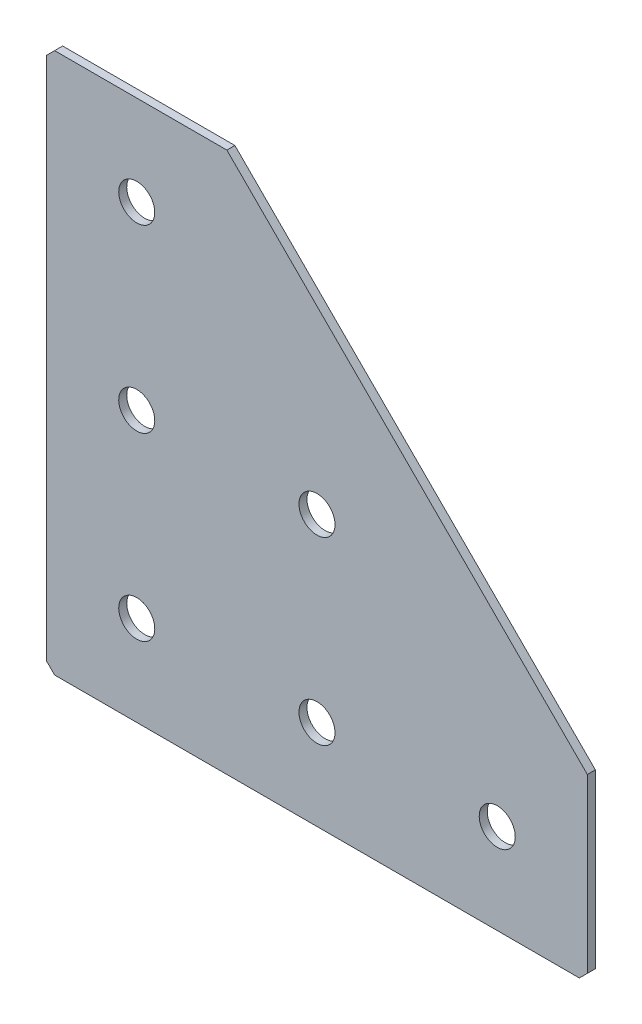
ISO-10303-21;
HEADER;
FILE_DESCRIPTION(('STEP AP214'),'2;1');
FILE_NAME('part.step','',(''),(''),'','','');
FILE_SCHEMA(('AUTOMOTIVE_DESIGN { 1 0 10303 214 1 1 1 1 }'));
ENDSEC;
DATA;
#1=APPLICATION_CONTEXT('core data for automotive mechanical design processes');
#2=APPLICATION_PROTOCOL_DEFINITION('international standard','automotive_design',2000,#1);
#3=PRODUCT_CONTEXT('',#1,'mechanical');
#4=PRODUCT('Part','Part','',(#3));
#5=PRODUCT_RELATED_PRODUCT_CATEGORY('part','',(#4));
#6=PRODUCT_DEFINITION_FORMATION('','',#4);
#7=PRODUCT_DEFINITION_CONTEXT('part definition',#1,'design');
#8=PRODUCT_DEFINITION('design','',#6,#7);
#9=PRODUCT_DEFINITION_SHAPE('','',#8);
#10=(LENGTH_UNIT() NAMED_UNIT(*) SI_UNIT(.MILLI.,.METRE.));
#11=(NAMED_UNIT(*) PLANE_ANGLE_UNIT() SI_UNIT($,.RADIAN.));
#12=(NAMED_UNIT(*) SI_UNIT($,.STERADIAN.) SOLID_ANGLE_UNIT());
#13=UNCERTAINTY_MEASURE_WITH_UNIT(LENGTH_MEASURE(1.E-05),#10,'distance_accuracy_value','');
#14=(GEOMETRIC_REPRESENTATION_CONTEXT(3) GLOBAL_UNCERTAINTY_ASSIGNED_CONTEXT((#13)) GLOBAL_UNIT_ASSIGNED_CONTEXT((#10,
#11,#12)) REPRESENTATION_CONTEXT('',''));
#15=CARTESIAN_POINT('',(0.,0.,0.));
#16=DIRECTION('',(0.,0.,1.));
#17=DIRECTION('',(1.,0.,0.));
#18=AXIS2_PLACEMENT_3D('',#15,#16,#17);
#19=CARTESIAN_POINT('',(45.,0.,-2.));
#20=DIRECTION('',(0.,-1.,0.));
#21=DIRECTION('',(1.,0.,0.));
#22=AXIS2_PLACEMENT_3D('',#19,#20,#21);
#23=PLANE('',#22);
#24=DIRECTION('',(1.,0.,0.));
#25=VECTOR('',#24,1.);
#26=CARTESIAN_POINT('',(45.,0.,-2.));
#27=LINE('',#26,#25);
#28=CARTESIAN_POINT('',(2.00000000000002,0.,-2.));
#29=VERTEX_POINT('',#28);
#30=CARTESIAN_POINT('',(45.,0.,-2.));
#31=VERTEX_POINT('',#30);
#32=EDGE_CURVE('E101',#29,#31,#27,.T.);
#33=ORIENTED_EDGE('',*,*,#32,.F.);
#34=DIRECTION('',(0.,0.,1.));
#35=VECTOR('',#34,1.);
#36=CARTESIAN_POINT('',(2.,0.,-2.));
#37=LINE('',#36,#35);
#38=CARTESIAN_POINT('',(2.00000000000002,0.,0.));
#39=VERTEX_POINT('',#38);
#40=EDGE_CURVE('E127',#29,#39,#37,.T.);
#41=ORIENTED_EDGE('',*,*,#40,.T.);
#42=DIRECTION('',(1.,0.,0.));
#43=VECTOR('',#42,1.);
#44=CARTESIAN_POINT('',(45.,0.,0.));
#45=LINE('',#44,#43);
#46=CARTESIAN_POINT('',(45.,0.,0.));
#47=VERTEX_POINT('',#46);
#48=EDGE_CURVE('E125',#39,#47,#45,.T.);
#49=ORIENTED_EDGE('',*,*,#48,.T.);
#50=DIRECTION('',(0.,0.,1.));
#51=VECTOR('',#50,1.);
#52=CARTESIAN_POINT('',(45.,0.,-2.));
#53=LINE('',#52,#51);
#54=EDGE_CURVE('E118',#31,#47,#53,.T.);
#55=ORIENTED_EDGE('',*,*,#54,.F.);
#56=EDGE_LOOP('',(#33,#41,#49,#55));
#57=FACE_BOUND('',#56,.T.);
#58=ADVANCED_FACE('F37',(#57),#23,.F.);
#59=CARTESIAN_POINT('',(135.,-90.,-2.));
#60=DIRECTION('',(-0.707106781186547,-0.707106781186547,0.));
#61=DIRECTION('',(0.707106781186548,-0.707106781186548,0.));
#62=AXIS2_PLACEMENT_3D('',#59,#60,#61);
#63=PLANE('',#62);
#64=DIRECTION('',(0.707106781186547,-0.707106781186547,0.));
#65=VECTOR('',#64,1.);
#66=CARTESIAN_POINT('',(135.,-90.,0.));
#67=LINE('',#66,#65);
#68=CARTESIAN_POINT('',(135.,-90.,0.));
#69=VERTEX_POINT('',#68);
#70=EDGE_CURVE('E164',#47,#69,#67,.T.);
#71=ORIENTED_EDGE('',*,*,#70,.T.);
#72=DIRECTION('',(0.,0.,1.));
#73=VECTOR('',#72,1.);
#74=CARTESIAN_POINT('',(135.,-90.,-2.));
#75=LINE('',#74,#73);
#76=CARTESIAN_POINT('',(135.,-90.,-2.));
#77=VERTEX_POINT('',#76);
#78=EDGE_CURVE('E120',#77,#69,#75,.T.);
#79=ORIENTED_EDGE('',*,*,#78,.F.);
#80=DIRECTION('',(0.707106781186547,-0.707106781186547,0.));
#81=VECTOR('',#80,1.);
#82=CARTESIAN_POINT('',(135.,-90.,-2.));
#83=LINE('',#82,#81);
#84=EDGE_CURVE('E105',#31,#77,#83,.T.);
#85=ORIENTED_EDGE('',*,*,#84,.F.);
#86=ORIENTED_EDGE('',*,*,#54,.T.);
#87=EDGE_LOOP('',(#71,#79,#85,#86));
#88=FACE_BOUND('',#87,.T.);
#89=ADVANCED_FACE('F117',(#88),#63,.F.);
#90=CARTESIAN_POINT('',(135.,-135.,-2.));
#91=DIRECTION('',(-1.,0.,0.));
#92=DIRECTION('',(0.,0.,1.));
#93=AXIS2_PLACEMENT_3D('',#90,#91,#92);
#94=PLANE('',#93);
#95=DIRECTION('',(0.,-1.,0.));
#96=VECTOR('',#95,1.);
#97=CARTESIAN_POINT('',(135.,-135.,0.));
#98=LINE('',#97,#96);
#99=CARTESIAN_POINT('',(135.,-133.,0.));
#100=VERTEX_POINT('',#99);
#101=EDGE_CURVE('E161',#69,#100,#98,.T.);
#102=ORIENTED_EDGE('',*,*,#101,.T.);
#103=DIRECTION('',(0.,0.,-1.));
#104=VECTOR('',#103,1.);
#105=CARTESIAN_POINT('',(135.,-133.,-2.));
#106=LINE('',#105,#104);
#107=CARTESIAN_POINT('',(135.,-133.,-2.));
#108=VERTEX_POINT('',#107);
#109=EDGE_CURVE('E11',#100,#108,#106,.T.);
#110=ORIENTED_EDGE('',*,*,#109,.T.);
#111=DIRECTION('',(0.,-1.,0.));
#112=VECTOR('',#111,1.);
#113=CARTESIAN_POINT('',(135.,-135.,-2.));
#114=LINE('',#113,#112);
#115=EDGE_CURVE('E122',#77,#108,#114,.T.);
#116=ORIENTED_EDGE('',*,*,#115,.F.);
#117=ORIENTED_EDGE('',*,*,#78,.T.);
#118=EDGE_LOOP('',(#102,#110,#116,#117));
#119=FACE_BOUND('',#118,.T.);
#120=ADVANCED_FACE('F245',(#119),#94,.F.);
#121=CARTESIAN_POINT('',(0.,-135.,-2.));
#122=DIRECTION('',(0.,1.,0.));
#123=DIRECTION('',(0.,0.,1.));
#124=AXIS2_PLACEMENT_3D('',#121,#122,#123);
#125=PLANE('',#124);
#126=DIRECTION('',(-1.,0.,0.));
#127=VECTOR('',#126,1.);
#128=CARTESIAN_POINT('',(0.,-135.,-2.));
#129=LINE('',#128,#127);
#130=CARTESIAN_POINT('',(133.,-135.,-2.));
#131=VERTEX_POINT('',#130);
#132=CARTESIAN_POINT('',(2.,-135.,-2.));
#133=VERTEX_POINT('',#132);
#134=EDGE_CURVE('E154',#131,#133,#129,.T.);
#135=ORIENTED_EDGE('',*,*,#134,.F.);
#136=DIRECTION('',(0.,0.,1.));
#137=VECTOR('',#136,1.);
#138=CARTESIAN_POINT('',(133.,-135.,-2.));
#139=LINE('',#138,#137);
#140=CARTESIAN_POINT('',(133.,-135.,0.));
#141=VERTEX_POINT('',#140);
#142=EDGE_CURVE('E45',#131,#141,#139,.T.);
#143=ORIENTED_EDGE('',*,*,#142,.T.);
#144=DIRECTION('',(-1.,0.,0.));
#145=VECTOR('',#144,1.);
#146=CARTESIAN_POINT('',(0.,-135.,0.));
#147=LINE('',#146,#145);
#148=CARTESIAN_POINT('',(2.,-135.,0.));
#149=VERTEX_POINT('',#148);
#150=EDGE_CURVE('E153',#141,#149,#147,.T.);
#151=ORIENTED_EDGE('',*,*,#150,.T.);
#152=DIRECTION('',(0.,0.,-1.));
#153=VECTOR('',#152,1.);
#154=CARTESIAN_POINT('',(2.,-135.,-2.));
#155=LINE('',#154,#153);
#156=EDGE_CURVE('E52',#149,#133,#155,.T.);
#157=ORIENTED_EDGE('',*,*,#156,.T.);
#158=EDGE_LOOP('',(#135,#143,#151,#157));
#159=FACE_BOUND('',#158,.T.);
#160=ADVANCED_FACE('F152',(#159),#125,.F.);
#161=CARTESIAN_POINT('',(0.,0.,-2.));
#162=DIRECTION('',(1.,0.,0.));
#163=DIRECTION('',(0.,0.,-1.));
#164=AXIS2_PLACEMENT_3D('',#161,#162,#163);
#165=PLANE('',#164);
#166=DIRECTION('',(0.,1.,0.));
#167=VECTOR('',#166,1.);
#168=CARTESIAN_POINT('',(0.,0.,0.));
#169=LINE('',#168,#167);
#170=CARTESIAN_POINT('',(0.,-133.,0.));
#171=VERTEX_POINT('',#170);
#172=CARTESIAN_POINT('',(0.,-2.00000000000003,0.));
#173=VERTEX_POINT('',#172);
#174=EDGE_CURVE('E113',#171,#173,#169,.T.);
#175=ORIENTED_EDGE('',*,*,#174,.T.);
#176=DIRECTION('',(0.,0.,-1.));
#177=VECTOR('',#176,1.);
#178=CARTESIAN_POINT('',(0.,-2.00000000000003,-2.));
#179=LINE('',#178,#177);
#180=CARTESIAN_POINT('',(0.,-2.00000000000003,-2.));
#181=VERTEX_POINT('',#180);
#182=EDGE_CURVE('E143',#173,#181,#179,.T.);
#183=ORIENTED_EDGE('',*,*,#182,.T.);
#184=DIRECTION('',(0.,1.,0.));
#185=VECTOR('',#184,1.);
#186=CARTESIAN_POINT('',(0.,0.,-2.));
#187=LINE('',#186,#185);
#188=CARTESIAN_POINT('',(0.,-133.,-2.));
#189=VERTEX_POINT('',#188);
#190=EDGE_CURVE('E131',#189,#181,#187,.T.);
#191=ORIENTED_EDGE('',*,*,#190,.F.);
#192=DIRECTION('',(0.,0.,1.));
#193=VECTOR('',#192,1.);
#194=CARTESIAN_POINT('',(0.,-133.,-2.));
#195=LINE('',#194,#193);
#196=EDGE_CURVE('E140',#189,#171,#195,.T.);
#197=ORIENTED_EDGE('',*,*,#196,.T.);
#198=EDGE_LOOP('',(#175,#183,#191,#197));
#199=FACE_BOUND('',#198,.T.);
#200=ADVANCED_FACE('F213',(#199),#165,.F.);
#201=CARTESIAN_POINT('',(0.,0.,-2.));
#202=DIRECTION('',(0.,0.,1.));
#203=DIRECTION('',(1.,0.,0.));
#204=AXIS2_PLACEMENT_3D('',#201,#202,#203);
#205=PLANE('',#204);
#206=CARTESIAN_POINT('',(67.5,-112.5,-2.00000000000001));
#207=DIRECTION('',(0.,0.,-1.));
#208=DIRECTION('',(0.,1.,0.));
#209=AXIS2_PLACEMENT_3D('',#206,#207,#208);
#210=CIRCLE('',#209,4.5);
#211=CARTESIAN_POINT('',(67.5,-108.,-2.00000000000001));
#212=VERTEX_POINT('',#211);
#213=EDGE_CURVE('E205',#212,#212,#210,.T.);
#214=ORIENTED_EDGE('',*,*,#213,.F.);
#215=EDGE_LOOP('',(#214));
#216=FACE_BOUND('',#215,.T.);
#217=CARTESIAN_POINT('',(22.5,-112.5,-2.00000000000001));
#218=DIRECTION('',(0.,0.,-1.));
#219=DIRECTION('',(0.,1.,0.));
#220=AXIS2_PLACEMENT_3D('',#217,#218,#219);
#221=CIRCLE('',#220,4.5);
#222=CARTESIAN_POINT('',(22.5,-108.,-2.00000000000001));
#223=VERTEX_POINT('',#222);
#224=EDGE_CURVE('E199',#223,#223,#221,.T.);
#225=ORIENTED_EDGE('',*,*,#224,.F.);
#226=EDGE_LOOP('',(#225));
#227=FACE_BOUND('',#226,.T.);
#228=CARTESIAN_POINT('',(22.5,-67.5,-2.));
#229=DIRECTION('',(0.,0.,-1.));
#230=DIRECTION('',(0.,1.,0.));
#231=AXIS2_PLACEMENT_3D('',#228,#229,#230);
#232=CIRCLE('',#231,4.5);
#233=CARTESIAN_POINT('',(22.5,-63.,-2.));
#234=VERTEX_POINT('',#233);
#235=EDGE_CURVE('E193',#234,#234,#232,.T.);
#236=ORIENTED_EDGE('',*,*,#235,.F.);
#237=EDGE_LOOP('',(#236));
#238=FACE_BOUND('',#237,.T.);
#239=CARTESIAN_POINT('',(22.5,-22.5,-2.));
#240=DIRECTION('',(0.,0.,-1.));
#241=DIRECTION('',(0.,1.,0.));
#242=AXIS2_PLACEMENT_3D('',#239,#240,#241);
#243=CIRCLE('',#242,4.5);
#244=CARTESIAN_POINT('',(22.5,-18.,-2.));
#245=VERTEX_POINT('',#244);
#246=EDGE_CURVE('E187',#245,#245,#243,.T.);
#247=ORIENTED_EDGE('',*,*,#246,.F.);
#248=EDGE_LOOP('',(#247));
#249=FACE_BOUND('',#248,.T.);
#250=CARTESIAN_POINT('',(112.5,-112.5,-2.00000000000001));
#251=DIRECTION('',(0.,0.,-1.));
#252=DIRECTION('',(0.,1.,0.));
#253=AXIS2_PLACEMENT_3D('',#250,#251,#252);
#254=CIRCLE('',#253,4.5);
#255=CARTESIAN_POINT('',(112.5,-108.,-2.00000000000001));
#256=VERTEX_POINT('',#255);
#257=EDGE_CURVE('E181',#256,#256,#254,.T.);
#258=ORIENTED_EDGE('',*,*,#257,.F.);
#259=EDGE_LOOP('',(#258));
#260=FACE_BOUND('',#259,.T.);
#261=CARTESIAN_POINT('',(67.5,-67.5,-2.));
#262=DIRECTION('',(0.,0.,-1.));
#263=DIRECTION('',(0.,1.,0.));
#264=AXIS2_PLACEMENT_3D('',#261,#262,#263);
#265=CIRCLE('',#264,4.5);
#266=CARTESIAN_POINT('',(67.5,-63.,-2.));
#267=VERTEX_POINT('',#266);
#268=EDGE_CURVE('E175',#267,#267,#265,.T.);
#269=ORIENTED_EDGE('',*,*,#268,.F.);
#270=EDGE_LOOP('',(#269));
#271=FACE_BOUND('',#270,.T.);
#272=ORIENTED_EDGE('',*,*,#190,.T.);
#273=DIRECTION('',(-0.707106781186543,-0.707106781186552,0.));
#274=VECTOR('',#273,1.);
#275=CARTESIAN_POINT('',(2.,0.,-2.));
#276=LINE('',#275,#274);
#277=EDGE_CURVE('E108',#181,#29,#276,.F.);
#278=ORIENTED_EDGE('',*,*,#277,.T.);
#279=ORIENTED_EDGE('',*,*,#32,.T.);
#280=ORIENTED_EDGE('',*,*,#84,.T.);
#281=ORIENTED_EDGE('',*,*,#115,.T.);
#282=DIRECTION('',(0.707106781186548,0.707106781186548,0.));
#283=VECTOR('',#282,1.);
#284=CARTESIAN_POINT('',(133.,-135.,-2.));
#285=LINE('',#284,#283);
#286=EDGE_CURVE('E59',#108,#131,#285,.F.);
#287=ORIENTED_EDGE('',*,*,#286,.T.);
#288=ORIENTED_EDGE('',*,*,#134,.T.);
#289=DIRECTION('',(0.707106781186548,-0.707106781186548,0.));
#290=VECTOR('',#289,1.);
#291=CARTESIAN_POINT('',(0.,-133.,-2.));
#292=LINE('',#291,#290);
#293=EDGE_CURVE('E145',#133,#189,#292,.F.);
#294=ORIENTED_EDGE('',*,*,#293,.T.);
#295=EDGE_LOOP('',(#272,#278,#279,#280,#281,#287,#288,#294));
#296=FACE_BOUND('',#295,.T.);
#297=ADVANCED_FACE('F104',(#216,#227,#238,#249,#260,#271,#296),#205,.F.);
#298=CARTESIAN_POINT('',(0.,0.,0.));
#299=DIRECTION('',(0.,0.,1.));
#300=DIRECTION('',(1.,0.,0.));
#301=AXIS2_PLACEMENT_3D('',#298,#299,#300);
#302=PLANE('',#301);
#303=CARTESIAN_POINT('',(67.5,-112.5,0.));
#304=DIRECTION('',(0.,0.,-1.));
#305=DIRECTION('',(0.,1.,0.));
#306=AXIS2_PLACEMENT_3D('',#303,#304,#305);
#307=CIRCLE('',#306,4.5);
#308=CARTESIAN_POINT('',(67.5,-108.,0.));
#309=VERTEX_POINT('',#308);
#310=EDGE_CURVE('E202',#309,#309,#307,.T.);
#311=ORIENTED_EDGE('',*,*,#310,.T.);
#312=EDGE_LOOP('',(#311));
#313=FACE_BOUND('',#312,.T.);
#314=CARTESIAN_POINT('',(22.5,-112.5,0.));
#315=DIRECTION('',(0.,0.,-1.));
#316=DIRECTION('',(0.,1.,0.));
#317=AXIS2_PLACEMENT_3D('',#314,#315,#316);
#318=CIRCLE('',#317,4.5);
#319=CARTESIAN_POINT('',(22.5,-108.,0.));
#320=VERTEX_POINT('',#319);
#321=EDGE_CURVE('E196',#320,#320,#318,.T.);
#322=ORIENTED_EDGE('',*,*,#321,.T.);
#323=EDGE_LOOP('',(#322));
#324=FACE_BOUND('',#323,.T.);
#325=CARTESIAN_POINT('',(22.5,-67.5,0.));
#326=DIRECTION('',(0.,0.,-1.));
#327=DIRECTION('',(0.,1.,0.));
#328=AXIS2_PLACEMENT_3D('',#325,#326,#327);
#329=CIRCLE('',#328,4.5);
#330=CARTESIAN_POINT('',(22.5,-63.,0.));
#331=VERTEX_POINT('',#330);
#332=EDGE_CURVE('E190',#331,#331,#329,.T.);
#333=ORIENTED_EDGE('',*,*,#332,.T.);
#334=EDGE_LOOP('',(#333));
#335=FACE_BOUND('',#334,.T.);
#336=CARTESIAN_POINT('',(22.5,-22.5,0.));
#337=DIRECTION('',(0.,0.,-1.));
#338=DIRECTION('',(0.,1.,0.));
#339=AXIS2_PLACEMENT_3D('',#336,#337,#338);
#340=CIRCLE('',#339,4.5);
#341=CARTESIAN_POINT('',(22.5,-18.,0.));
#342=VERTEX_POINT('',#341);
#343=EDGE_CURVE('E184',#342,#342,#340,.T.);
#344=ORIENTED_EDGE('',*,*,#343,.T.);
#345=EDGE_LOOP('',(#344));
#346=FACE_BOUND('',#345,.T.);
#347=CARTESIAN_POINT('',(112.5,-112.5,0.));
#348=DIRECTION('',(0.,0.,-1.));
#349=DIRECTION('',(0.,1.,0.));
#350=AXIS2_PLACEMENT_3D('',#347,#348,#349);
#351=CIRCLE('',#350,4.5);
#352=CARTESIAN_POINT('',(112.5,-108.,0.));
#353=VERTEX_POINT('',#352);
#354=EDGE_CURVE('E178',#353,#353,#351,.T.);
#355=ORIENTED_EDGE('',*,*,#354,.T.);
#356=EDGE_LOOP('',(#355));
#357=FACE_BOUND('',#356,.T.);
#358=CARTESIAN_POINT('',(67.5,-67.5,0.));
#359=DIRECTION('',(0.,0.,-1.));
#360=DIRECTION('',(0.,1.,0.));
#361=AXIS2_PLACEMENT_3D('',#358,#359,#360);
#362=CIRCLE('',#361,4.5);
#363=CARTESIAN_POINT('',(67.5,-63.,0.));
#364=VERTEX_POINT('',#363);
#365=EDGE_CURVE('E169',#364,#364,#362,.T.);
#366=ORIENTED_EDGE('',*,*,#365,.T.);
#367=EDGE_LOOP('',(#366));
#368=FACE_BOUND('',#367,.T.);
#369=ORIENTED_EDGE('',*,*,#48,.F.);
#370=DIRECTION('',(0.707106781186543,0.707106781186552,0.));
#371=VECTOR('',#370,1.);
#372=CARTESIAN_POINT('',(1.00000000000001,-1.,0.));
#373=LINE('',#372,#371);
#374=EDGE_CURVE('E138',#39,#173,#373,.F.);
#375=ORIENTED_EDGE('',*,*,#374,.T.);
#376=ORIENTED_EDGE('',*,*,#174,.F.);
#377=DIRECTION('',(-0.707106781186548,0.707106781186548,0.));
#378=VECTOR('',#377,1.);
#379=CARTESIAN_POINT('',(-66.5,-66.5,0.));
#380=LINE('',#379,#378);
#381=EDGE_CURVE('E129',#171,#149,#380,.F.);
#382=ORIENTED_EDGE('',*,*,#381,.T.);
#383=ORIENTED_EDGE('',*,*,#150,.F.);
#384=DIRECTION('',(-0.707106781186548,-0.707106781186548,0.));
#385=VECTOR('',#384,1.);
#386=CARTESIAN_POINT('',(134.,-134.,0.));
#387=LINE('',#386,#385);
#388=EDGE_CURVE('E136',#141,#100,#387,.F.);
#389=ORIENTED_EDGE('',*,*,#388,.T.);
#390=ORIENTED_EDGE('',*,*,#101,.F.);
#391=ORIENTED_EDGE('',*,*,#70,.F.);
#392=EDGE_LOOP('',(#369,#375,#376,#382,#383,#389,#390,#391));
#393=FACE_BOUND('',#392,.T.);
#394=ADVANCED_FACE('F157',(#313,#324,#335,#346,#357,#368,#393),#302,.T.);
#395=CARTESIAN_POINT('',(67.5,-67.5,-2.));
#396=DIRECTION('',(0.,0.,-1.));
#397=DIRECTION('',(0.,1.,0.));
#398=AXIS2_PLACEMENT_3D('',#395,#396,#397);
#399=CYLINDRICAL_SURFACE('',#398,4.5);
#400=ORIENTED_EDGE('',*,*,#365,.F.);
#401=EDGE_LOOP('',(#400));
#402=FACE_BOUND('',#401,.T.);
#403=ORIENTED_EDGE('',*,*,#268,.T.);
#404=EDGE_LOOP('',(#403));
#405=FACE_BOUND('',#404,.T.);
#406=ADVANCED_FACE('F225',(#402,#405),#399,.F.);
#407=CARTESIAN_POINT('',(112.5,-112.5,-2.00000000000001));
#408=DIRECTION('',(0.,0.,-1.));
#409=DIRECTION('',(0.,1.,0.));
#410=AXIS2_PLACEMENT_3D('',#407,#408,#409);
#411=CYLINDRICAL_SURFACE('',#410,4.5);
#412=ORIENTED_EDGE('',*,*,#354,.F.);
#413=EDGE_LOOP('',(#412));
#414=FACE_BOUND('',#413,.T.);
#415=ORIENTED_EDGE('',*,*,#257,.T.);
#416=EDGE_LOOP('',(#415));
#417=FACE_BOUND('',#416,.T.);
#418=ADVANCED_FACE('F227',(#414,#417),#411,.F.);
#419=CARTESIAN_POINT('',(22.5,-22.5,-2.));
#420=DIRECTION('',(0.,0.,-1.));
#421=DIRECTION('',(0.,1.,0.));
#422=AXIS2_PLACEMENT_3D('',#419,#420,#421);
#423=CYLINDRICAL_SURFACE('',#422,4.5);
#424=ORIENTED_EDGE('',*,*,#343,.F.);
#425=EDGE_LOOP('',(#424));
#426=FACE_BOUND('',#425,.T.);
#427=ORIENTED_EDGE('',*,*,#246,.T.);
#428=EDGE_LOOP('',(#427));
#429=FACE_BOUND('',#428,.T.);
#430=ADVANCED_FACE('F234',(#426,#429),#423,.F.);
#431=CARTESIAN_POINT('',(22.5,-67.5,-2.));
#432=DIRECTION('',(0.,0.,-1.));
#433=DIRECTION('',(0.,1.,0.));
#434=AXIS2_PLACEMENT_3D('',#431,#432,#433);
#435=CYLINDRICAL_SURFACE('',#434,4.5);
#436=ORIENTED_EDGE('',*,*,#332,.F.);
#437=EDGE_LOOP('',(#436));
#438=FACE_BOUND('',#437,.T.);
#439=ORIENTED_EDGE('',*,*,#235,.T.);
#440=EDGE_LOOP('',(#439));
#441=FACE_BOUND('',#440,.T.);
#442=ADVANCED_FACE('F329',(#438,#441),#435,.F.);
#443=CARTESIAN_POINT('',(22.5,-112.5,-2.00000000000001));
#444=DIRECTION('',(0.,0.,-1.));
#445=DIRECTION('',(0.,1.,0.));
#446=AXIS2_PLACEMENT_3D('',#443,#444,#445);
#447=CYLINDRICAL_SURFACE('',#446,4.5);
#448=ORIENTED_EDGE('',*,*,#321,.F.);
#449=EDGE_LOOP('',(#448));
#450=FACE_BOUND('',#449,.T.);
#451=ORIENTED_EDGE('',*,*,#224,.T.);
#452=EDGE_LOOP('',(#451));
#453=FACE_BOUND('',#452,.T.);
#454=ADVANCED_FACE('F322',(#450,#453),#447,.F.);
#455=CARTESIAN_POINT('',(67.5,-112.5,-2.00000000000001));
#456=DIRECTION('',(0.,0.,-1.));
#457=DIRECTION('',(0.,1.,0.));
#458=AXIS2_PLACEMENT_3D('',#455,#456,#457);
#459=CYLINDRICAL_SURFACE('',#458,4.5);
#460=ORIENTED_EDGE('',*,*,#310,.F.);
#461=EDGE_LOOP('',(#460));
#462=FACE_BOUND('',#461,.T.);
#463=ORIENTED_EDGE('',*,*,#213,.T.);
#464=EDGE_LOOP('',(#463));
#465=FACE_BOUND('',#464,.T.);
#466=ADVANCED_FACE('F209',(#462,#465),#459,.F.);
#467=CARTESIAN_POINT('',(2.,0.,-2.));
#468=DIRECTION('',(0.707106781186552,-0.707106781186542,0.));
#469=DIRECTION('',(0.,0.,1.));
#470=AXIS2_PLACEMENT_3D('',#467,#468,#469);
#471=PLANE('',#470);
#472=ORIENTED_EDGE('',*,*,#277,.F.);
#473=ORIENTED_EDGE('',*,*,#182,.F.);
#474=ORIENTED_EDGE('',*,*,#374,.F.);
#475=ORIENTED_EDGE('',*,*,#40,.F.);
#476=EDGE_LOOP('',(#472,#473,#474,#475));
#477=FACE_BOUND('',#476,.T.);
#478=ADVANCED_FACE('F249',(#477),#471,.F.);
#479=CARTESIAN_POINT('',(133.,-135.,-2.));
#480=DIRECTION('',(-0.707106781186547,0.707106781186547,0.));
#481=DIRECTION('',(0.,0.,1.));
#482=AXIS2_PLACEMENT_3D('',#479,#480,#481);
#483=PLANE('',#482);
#484=ORIENTED_EDGE('',*,*,#286,.F.);
#485=ORIENTED_EDGE('',*,*,#109,.F.);
#486=ORIENTED_EDGE('',*,*,#388,.F.);
#487=ORIENTED_EDGE('',*,*,#142,.F.);
#488=EDGE_LOOP('',(#484,#485,#486,#487));
#489=FACE_BOUND('',#488,.T.);
#490=ADVANCED_FACE('F251',(#489),#483,.F.);
#491=CARTESIAN_POINT('',(0.,-133.,-2.));
#492=DIRECTION('',(0.707106781186547,0.707106781186547,0.));
#493=DIRECTION('',(0.,0.,1.));
#494=AXIS2_PLACEMENT_3D('',#491,#492,#493);
#495=PLANE('',#494);
#496=ORIENTED_EDGE('',*,*,#293,.F.);
#497=ORIENTED_EDGE('',*,*,#156,.F.);
#498=ORIENTED_EDGE('',*,*,#381,.F.);
#499=ORIENTED_EDGE('',*,*,#196,.F.);
#500=EDGE_LOOP('',(#496,#497,#498,#499));
#501=FACE_BOUND('',#500,.T.);
#502=ADVANCED_FACE('F39',(#501),#495,.F.);
#503=CLOSED_SHELL('',(#58,#89,#120,#160,#200,#297,#394,#406,#418,#430,#442,#454,#466,#478,#490,#502));
#504=MANIFOLD_SOLID_BREP('B2',#503);
#505=ADVANCED_BREP_SHAPE_REPRESENTATION('',(#18,#504),#14);
#506=SHAPE_DEFINITION_REPRESENTATION(#9,#505);
ENDSEC;
END-ISO-10303-21;
